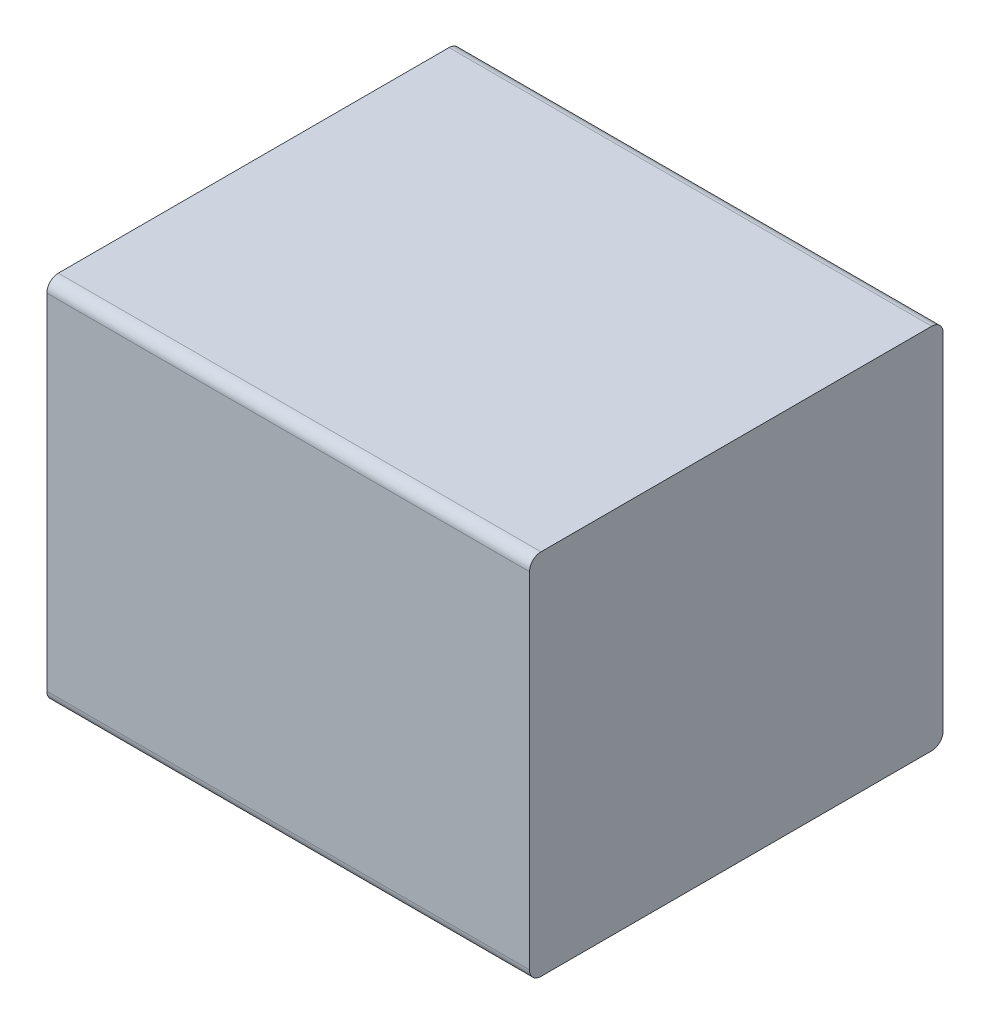
ISO-10303-21;
HEADER;
FILE_DESCRIPTION(('STEP AP214'),'2;1');
FILE_NAME('part.step','',(''),(''),'','','');
FILE_SCHEMA(('AUTOMOTIVE_DESIGN { 1 0 10303 214 1 1 1 1 }'));
ENDSEC;
DATA;
#1=APPLICATION_CONTEXT('core data for automotive mechanical design processes');
#2=APPLICATION_PROTOCOL_DEFINITION('international standard','automotive_design',2000,#1);
#3=PRODUCT_CONTEXT('',#1,'mechanical');
#4=PRODUCT('Part','Part','',(#3));
#5=PRODUCT_RELATED_PRODUCT_CATEGORY('part','',(#4));
#6=PRODUCT_DEFINITION_FORMATION('','',#4);
#7=PRODUCT_DEFINITION_CONTEXT('part definition',#1,'design');
#8=PRODUCT_DEFINITION('design','',#6,#7);
#9=PRODUCT_DEFINITION_SHAPE('','',#8);
#10=(LENGTH_UNIT() NAMED_UNIT(*) SI_UNIT(.MILLI.,.METRE.));
#11=(NAMED_UNIT(*) PLANE_ANGLE_UNIT() SI_UNIT($,.RADIAN.));
#12=(NAMED_UNIT(*) SI_UNIT($,.STERADIAN.) SOLID_ANGLE_UNIT());
#13=UNCERTAINTY_MEASURE_WITH_UNIT(LENGTH_MEASURE(1.E-05),#10,'distance_accuracy_value','');
#14=(GEOMETRIC_REPRESENTATION_CONTEXT(3) GLOBAL_UNCERTAINTY_ASSIGNED_CONTEXT((#13)) GLOBAL_UNIT_ASSIGNED_CONTEXT((#10,
#11,#12)) REPRESENTATION_CONTEXT('',''));
#15=CARTESIAN_POINT('',(0.,0.,0.));
#16=DIRECTION('',(0.,0.,1.));
#17=DIRECTION('',(1.,0.,0.));
#18=AXIS2_PLACEMENT_3D('',#15,#16,#17);
#19=CARTESIAN_POINT('',(0.525,0.75,0.05));
#20=DIRECTION('',(1.,0.,0.));
#21=DIRECTION('',(0.,0.707106781186548,-0.707106781186547));
#22=AXIS2_PLACEMENT_3D('',#19,#20,#21);
#23=CYLINDRICAL_SURFACE('',#22,0.05);
#24=CARTESIAN_POINT('',(1.05,0.75,0.05));
#25=DIRECTION('',(-1.,0.,0.));
#26=DIRECTION('',(0.,0.707106781186548,-0.707106781186547));
#27=AXIS2_PLACEMENT_3D('',#24,#25,#26);
#28=CIRCLE('',#27,0.05);
#29=CARTESIAN_POINT('',(1.05,0.8,0.05));
#30=VERTEX_POINT('',#29);
#31=CARTESIAN_POINT('',(1.05,0.75,0.));
#32=VERTEX_POINT('',#31);
#33=EDGE_CURVE('E11',#30,#32,#28,.T.);
#34=ORIENTED_EDGE('',*,*,#33,.T.);
#35=DIRECTION('',(-1.,0.,0.));
#36=VECTOR('',#35,1.);
#37=CARTESIAN_POINT('',(0.525,0.75,0.));
#38=LINE('',#37,#36);
#39=CARTESIAN_POINT('',(-1.05,0.75,0.));
#40=VERTEX_POINT('',#39);
#41=EDGE_CURVE('E24',#32,#40,#38,.T.);
#42=ORIENTED_EDGE('',*,*,#41,.T.);
#43=CARTESIAN_POINT('',(-1.05,0.75,0.05));
#44=DIRECTION('',(1.,0.,0.));
#45=DIRECTION('',(0.,0.707106781186548,-0.707106781186547));
#46=AXIS2_PLACEMENT_3D('',#43,#44,#45);
#47=CIRCLE('',#46,0.05);
#48=CARTESIAN_POINT('',(-1.05,0.8,0.05));
#49=VERTEX_POINT('',#48);
#50=EDGE_CURVE('E142',#40,#49,#47,.T.);
#51=ORIENTED_EDGE('',*,*,#50,.T.);
#52=DIRECTION('',(1.,0.,0.));
#53=VECTOR('',#52,1.);
#54=CARTESIAN_POINT('',(0.525,0.8,0.05));
#55=LINE('',#54,#53);
#56=EDGE_CURVE('E140',#49,#30,#55,.T.);
#57=ORIENTED_EDGE('',*,*,#56,.T.);
#58=EDGE_LOOP('',(#34,#42,#51,#57));
#59=FACE_BOUND('',#58,.T.);
#60=ADVANCED_FACE('F17',(#59),#23,.T.);
#61=CARTESIAN_POINT('',(1.05,0.8,0.));
#62=DIRECTION('',(0.,1.,0.));
#63=DIRECTION('',(-1.,0.,0.));
#64=AXIS2_PLACEMENT_3D('',#61,#62,#63);
#65=PLANE('',#64);
#66=ORIENTED_EDGE('',*,*,#56,.F.);
#67=DIRECTION('',(0.,0.,1.));
#68=VECTOR('',#67,1.);
#69=CARTESIAN_POINT('',(-1.05,0.8,0.));
#70=LINE('',#69,#68);
#71=CARTESIAN_POINT('',(-1.05,0.8,1.75));
#72=VERTEX_POINT('',#71);
#73=EDGE_CURVE('E138',#49,#72,#70,.T.);
#74=ORIENTED_EDGE('',*,*,#73,.T.);
#75=DIRECTION('',(-1.,0.,0.));
#76=VECTOR('',#75,1.);
#77=CARTESIAN_POINT('',(0.525,0.8,1.75));
#78=LINE('',#77,#76);
#79=CARTESIAN_POINT('',(1.05,0.8,1.75));
#80=VERTEX_POINT('',#79);
#81=EDGE_CURVE('E135',#80,#72,#78,.T.);
#82=ORIENTED_EDGE('',*,*,#81,.F.);
#83=DIRECTION('',(0.,0.,1.));
#84=VECTOR('',#83,1.);
#85=CARTESIAN_POINT('',(1.05,0.8,0.));
#86=LINE('',#85,#84);
#87=EDGE_CURVE('E133',#30,#80,#86,.T.);
#88=ORIENTED_EDGE('',*,*,#87,.F.);
#89=EDGE_LOOP('',(#66,#74,#82,#88));
#90=FACE_BOUND('',#89,.T.);
#91=ADVANCED_FACE('F163',(#90),#65,.T.);
#92=CARTESIAN_POINT('',(-1.05,0.8,0.));
#93=DIRECTION('',(-1.,0.,0.));
#94=DIRECTION('',(0.,-1.,0.));
#95=AXIS2_PLACEMENT_3D('',#92,#93,#94);
#96=PLANE('',#95);
#97=ORIENTED_EDGE('',*,*,#50,.F.);
#98=DIRECTION('',(0.,1.,0.));
#99=VECTOR('',#98,1.);
#100=CARTESIAN_POINT('',(-1.05,-0.8,0.));
#101=LINE('',#100,#99);
#102=CARTESIAN_POINT('',(-1.05,-0.75,0.));
#103=VERTEX_POINT('',#102);
#104=EDGE_CURVE('E130',#103,#40,#101,.T.);
#105=ORIENTED_EDGE('',*,*,#104,.F.);
#106=CARTESIAN_POINT('',(-1.05,-0.75,0.05));
#107=DIRECTION('',(1.,0.,0.));
#108=DIRECTION('',(0.,-0.707106781186548,-0.707106781186547));
#109=AXIS2_PLACEMENT_3D('',#106,#107,#108);
#110=CIRCLE('',#109,0.05);
#111=CARTESIAN_POINT('',(-1.05,-0.8,0.05));
#112=VERTEX_POINT('',#111);
#113=EDGE_CURVE('E127',#112,#103,#110,.T.);
#114=ORIENTED_EDGE('',*,*,#113,.F.);
#115=DIRECTION('',(0.,0.,1.));
#116=VECTOR('',#115,1.);
#117=CARTESIAN_POINT('',(-1.05,-0.8,0.));
#118=LINE('',#117,#116);
#119=CARTESIAN_POINT('',(-1.05,-0.8,1.75));
#120=VERTEX_POINT('',#119);
#121=EDGE_CURVE('E125',#112,#120,#118,.T.);
#122=ORIENTED_EDGE('',*,*,#121,.T.);
#123=CARTESIAN_POINT('',(-1.05,-0.75,1.75));
#124=DIRECTION('',(1.,0.,0.));
#125=DIRECTION('',(0.,-0.707106781186548,0.707106781186548));
#126=AXIS2_PLACEMENT_3D('',#123,#124,#125);
#127=CIRCLE('',#126,0.05);
#128=CARTESIAN_POINT('',(-1.05,-0.75,1.8));
#129=VERTEX_POINT('',#128);
#130=EDGE_CURVE('E123',#129,#120,#127,.T.);
#131=ORIENTED_EDGE('',*,*,#130,.F.);
#132=DIRECTION('',(0.,-1.,0.));
#133=VECTOR('',#132,1.);
#134=CARTESIAN_POINT('',(-1.05,-0.8,1.8));
#135=LINE('',#134,#133);
#136=CARTESIAN_POINT('',(-1.05,0.75,1.8));
#137=VERTEX_POINT('',#136);
#138=EDGE_CURVE('E101',#137,#129,#135,.T.);
#139=ORIENTED_EDGE('',*,*,#138,.F.);
#140=CARTESIAN_POINT('',(-1.05,0.75,1.75));
#141=DIRECTION('',(1.,0.,0.));
#142=DIRECTION('',(0.,0.707106781186548,0.707106781186548));
#143=AXIS2_PLACEMENT_3D('',#140,#141,#142);
#144=CIRCLE('',#143,0.05);
#145=EDGE_CURVE('E119',#72,#137,#144,.T.);
#146=ORIENTED_EDGE('',*,*,#145,.F.);
#147=ORIENTED_EDGE('',*,*,#73,.F.);
#148=EDGE_LOOP('',(#97,#105,#114,#122,#131,#139,#146,#147));
#149=FACE_BOUND('',#148,.T.);
#150=ADVANCED_FACE('F148',(#149),#96,.T.);
#151=CARTESIAN_POINT('',(-0.525,-0.75,0.05));
#152=DIRECTION('',(-1.,0.,0.));
#153=DIRECTION('',(0.,-0.707106781186548,-0.707106781186547));
#154=AXIS2_PLACEMENT_3D('',#151,#152,#153);
#155=CYLINDRICAL_SURFACE('',#154,0.05);
#156=ORIENTED_EDGE('',*,*,#113,.T.);
#157=DIRECTION('',(1.,0.,0.));
#158=VECTOR('',#157,1.);
#159=CARTESIAN_POINT('',(-0.525,-0.75,0.));
#160=LINE('',#159,#158);
#161=CARTESIAN_POINT('',(1.05,-0.75,0.));
#162=VERTEX_POINT('',#161);
#163=EDGE_CURVE('E117',#103,#162,#160,.T.);
#164=ORIENTED_EDGE('',*,*,#163,.T.);
#165=CARTESIAN_POINT('',(1.05,-0.75,0.05));
#166=DIRECTION('',(-1.,0.,0.));
#167=DIRECTION('',(0.,-0.707106781186548,-0.707106781186547));
#168=AXIS2_PLACEMENT_3D('',#165,#166,#167);
#169=CIRCLE('',#168,0.05);
#170=CARTESIAN_POINT('',(1.05,-0.8,0.05));
#171=VERTEX_POINT('',#170);
#172=EDGE_CURVE('E115',#162,#171,#169,.T.);
#173=ORIENTED_EDGE('',*,*,#172,.T.);
#174=DIRECTION('',(-1.,0.,0.));
#175=VECTOR('',#174,1.);
#176=CARTESIAN_POINT('',(-0.525,-0.8,0.05));
#177=LINE('',#176,#175);
#178=EDGE_CURVE('E112',#171,#112,#177,.T.);
#179=ORIENTED_EDGE('',*,*,#178,.T.);
#180=EDGE_LOOP('',(#156,#164,#173,#179));
#181=FACE_BOUND('',#180,.T.);
#182=ADVANCED_FACE('F154',(#181),#155,.T.);
#183=CARTESIAN_POINT('',(-1.05,-0.8,0.));
#184=DIRECTION('',(0.,-1.,0.));
#185=DIRECTION('',(1.,0.,0.));
#186=AXIS2_PLACEMENT_3D('',#183,#184,#185);
#187=PLANE('',#186);
#188=ORIENTED_EDGE('',*,*,#178,.F.);
#189=DIRECTION('',(0.,0.,1.));
#190=VECTOR('',#189,1.);
#191=CARTESIAN_POINT('',(1.05,-0.8,0.));
#192=LINE('',#191,#190);
#193=CARTESIAN_POINT('',(1.05,-0.8,1.75));
#194=VERTEX_POINT('',#193);
#195=EDGE_CURVE('E110',#171,#194,#192,.T.);
#196=ORIENTED_EDGE('',*,*,#195,.T.);
#197=DIRECTION('',(1.,0.,0.));
#198=VECTOR('',#197,1.);
#199=CARTESIAN_POINT('',(-0.525,-0.8,1.75));
#200=LINE('',#199,#198);
#201=EDGE_CURVE('E96',#120,#194,#200,.T.);
#202=ORIENTED_EDGE('',*,*,#201,.F.);
#203=ORIENTED_EDGE('',*,*,#121,.F.);
#204=EDGE_LOOP('',(#188,#196,#202,#203));
#205=FACE_BOUND('',#204,.T.);
#206=ADVANCED_FACE('F157',(#205),#187,.T.);
#207=CARTESIAN_POINT('',(1.05,-0.8,0.));
#208=DIRECTION('',(1.,0.,0.));
#209=DIRECTION('',(0.,1.,0.));
#210=AXIS2_PLACEMENT_3D('',#207,#208,#209);
#211=PLANE('',#210);
#212=ORIENTED_EDGE('',*,*,#33,.F.);
#213=ORIENTED_EDGE('',*,*,#87,.T.);
#214=CARTESIAN_POINT('',(1.05,0.75,1.75));
#215=DIRECTION('',(-1.,0.,0.));
#216=DIRECTION('',(0.,0.707106781186548,0.707106781186548));
#217=AXIS2_PLACEMENT_3D('',#214,#215,#216);
#218=CIRCLE('',#217,0.05);
#219=CARTESIAN_POINT('',(1.05,0.75,1.8));
#220=VERTEX_POINT('',#219);
#221=EDGE_CURVE('E83',#220,#80,#218,.T.);
#222=ORIENTED_EDGE('',*,*,#221,.F.);
#223=DIRECTION('',(0.,1.,0.));
#224=VECTOR('',#223,1.);
#225=CARTESIAN_POINT('',(1.05,0.8,1.8));
#226=LINE('',#225,#224);
#227=CARTESIAN_POINT('',(1.05,-0.75,1.8));
#228=VERTEX_POINT('',#227);
#229=EDGE_CURVE('E77',#228,#220,#226,.T.);
#230=ORIENTED_EDGE('',*,*,#229,.F.);
#231=CARTESIAN_POINT('',(1.05,-0.75,1.75));
#232=DIRECTION('',(-1.,0.,0.));
#233=DIRECTION('',(0.,-0.707106781186548,0.707106781186548));
#234=AXIS2_PLACEMENT_3D('',#231,#232,#233);
#235=CIRCLE('',#234,0.05);
#236=EDGE_CURVE('E81',#194,#228,#235,.T.);
#237=ORIENTED_EDGE('',*,*,#236,.F.);
#238=ORIENTED_EDGE('',*,*,#195,.F.);
#239=ORIENTED_EDGE('',*,*,#172,.F.);
#240=DIRECTION('',(0.,-1.,0.));
#241=VECTOR('',#240,1.);
#242=CARTESIAN_POINT('',(1.05,0.8,0.));
#243=LINE('',#242,#241);
#244=EDGE_CURVE('E97',#32,#162,#243,.T.);
#245=ORIENTED_EDGE('',*,*,#244,.F.);
#246=EDGE_LOOP('',(#212,#213,#222,#230,#237,#238,#239,#245));
#247=FACE_BOUND('',#246,.T.);
#248=ADVANCED_FACE('F79',(#247),#211,.T.);
#249=CARTESIAN_POINT('',(0.525,0.75,1.75));
#250=DIRECTION('',(-1.,0.,0.));
#251=DIRECTION('',(0.,0.707106781186548,0.707106781186548));
#252=AXIS2_PLACEMENT_3D('',#249,#250,#251);
#253=CYLINDRICAL_SURFACE('',#252,0.05);
#254=ORIENTED_EDGE('',*,*,#145,.T.);
#255=DIRECTION('',(1.,0.,0.));
#256=VECTOR('',#255,1.);
#257=CARTESIAN_POINT('',(0.525,0.75,1.8));
#258=LINE('',#257,#256);
#259=EDGE_CURVE('E102',#137,#220,#258,.T.);
#260=ORIENTED_EDGE('',*,*,#259,.T.);
#261=ORIENTED_EDGE('',*,*,#221,.T.);
#262=ORIENTED_EDGE('',*,*,#81,.T.);
#263=EDGE_LOOP('',(#254,#260,#261,#262));
#264=FACE_BOUND('',#263,.T.);
#265=ADVANCED_FACE('F160',(#264),#253,.T.);
#266=CARTESIAN_POINT('',(0.,0.,1.8));
#267=DIRECTION('',(0.,0.,1.));
#268=DIRECTION('',(1.,0.,0.));
#269=AXIS2_PLACEMENT_3D('',#266,#267,#268);
#270=PLANE('',#269);
#271=ORIENTED_EDGE('',*,*,#259,.F.);
#272=ORIENTED_EDGE('',*,*,#138,.T.);
#273=DIRECTION('',(-1.,0.,0.));
#274=VECTOR('',#273,1.);
#275=CARTESIAN_POINT('',(-0.525,-0.75,1.8));
#276=LINE('',#275,#274);
#277=EDGE_CURVE('E94',#228,#129,#276,.T.);
#278=ORIENTED_EDGE('',*,*,#277,.F.);
#279=ORIENTED_EDGE('',*,*,#229,.T.);
#280=EDGE_LOOP('',(#271,#272,#278,#279));
#281=FACE_BOUND('',#280,.T.);
#282=ADVANCED_FACE('F100',(#281),#270,.T.);
#283=CARTESIAN_POINT('',(-0.525,-0.75,1.75));
#284=DIRECTION('',(1.,0.,0.));
#285=DIRECTION('',(0.,-0.707106781186548,0.707106781186548));
#286=AXIS2_PLACEMENT_3D('',#283,#284,#285);
#287=CYLINDRICAL_SURFACE('',#286,0.05);
#288=ORIENTED_EDGE('',*,*,#236,.T.);
#289=ORIENTED_EDGE('',*,*,#277,.T.);
#290=ORIENTED_EDGE('',*,*,#130,.T.);
#291=ORIENTED_EDGE('',*,*,#201,.T.);
#292=EDGE_LOOP('',(#288,#289,#290,#291));
#293=FACE_BOUND('',#292,.T.);
#294=ADVANCED_FACE('F92',(#293),#287,.T.);
#295=CARTESIAN_POINT('',(0.,0.,0.));
#296=DIRECTION('',(0.,0.,1.));
#297=DIRECTION('',(1.,0.,0.));
#298=AXIS2_PLACEMENT_3D('',#295,#296,#297);
#299=PLANE('',#298);
#300=ORIENTED_EDGE('',*,*,#41,.F.);
#301=ORIENTED_EDGE('',*,*,#244,.T.);
#302=ORIENTED_EDGE('',*,*,#163,.F.);
#303=ORIENTED_EDGE('',*,*,#104,.T.);
#304=EDGE_LOOP('',(#300,#301,#302,#303));
#305=FACE_BOUND('',#304,.T.);
#306=ADVANCED_FACE('F151',(#305),#299,.F.);
#307=CLOSED_SHELL('',(#60,#91,#150,#182,#206,#248,#265,#282,#294,#306));
#308=MANIFOLD_SOLID_BREP('B1',#307);
#309=ADVANCED_BREP_SHAPE_REPRESENTATION('',(#18,#308),#14);
#310=SHAPE_DEFINITION_REPRESENTATION(#9,#309);
ENDSEC;
END-ISO-10303-21;
